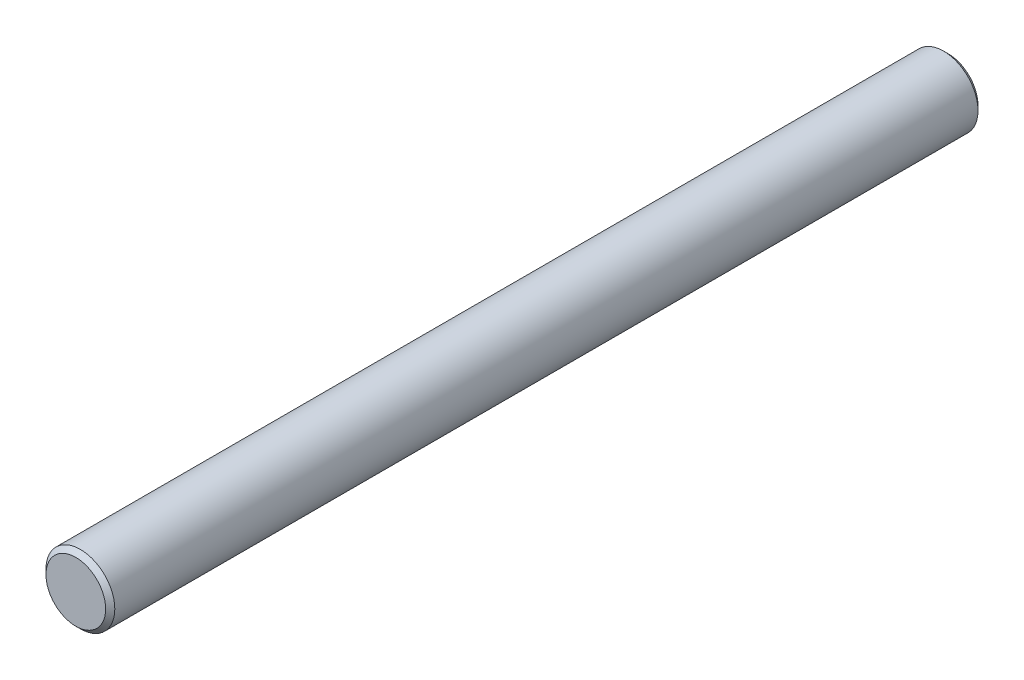
ISO-10303-21;
HEADER;
FILE_DESCRIPTION(('STEP AP214'),'2;1');
FILE_NAME('part.step','',(''),(''),'','','');
FILE_SCHEMA(('AUTOMOTIVE_DESIGN { 1 0 10303 214 1 1 1 1 }'));
ENDSEC;
DATA;
#1=APPLICATION_CONTEXT('core data for automotive mechanical design processes');
#2=APPLICATION_PROTOCOL_DEFINITION('international standard','automotive_design',2000,#1);
#3=PRODUCT_CONTEXT('',#1,'mechanical');
#4=PRODUCT('Part','Part','',(#3));
#5=PRODUCT_RELATED_PRODUCT_CATEGORY('part','',(#4));
#6=PRODUCT_DEFINITION_FORMATION('','',#4);
#7=PRODUCT_DEFINITION_CONTEXT('part definition',#1,'design');
#8=PRODUCT_DEFINITION('design','',#6,#7);
#9=PRODUCT_DEFINITION_SHAPE('','',#8);
#10=(LENGTH_UNIT() NAMED_UNIT(*) SI_UNIT(.MILLI.,.METRE.));
#11=(NAMED_UNIT(*) PLANE_ANGLE_UNIT() SI_UNIT($,.RADIAN.));
#12=(NAMED_UNIT(*) SI_UNIT($,.STERADIAN.) SOLID_ANGLE_UNIT());
#13=UNCERTAINTY_MEASURE_WITH_UNIT(LENGTH_MEASURE(1.E-05),#10,'distance_accuracy_value','');
#14=(GEOMETRIC_REPRESENTATION_CONTEXT(3) GLOBAL_UNCERTAINTY_ASSIGNED_CONTEXT((#13)) GLOBAL_UNIT_ASSIGNED_CONTEXT((#10,
#11,#12)) REPRESENTATION_CONTEXT('',''));
#15=CARTESIAN_POINT('',(0.,0.,0.));
#16=DIRECTION('',(0.,0.,1.));
#17=DIRECTION('',(1.,0.,0.));
#18=AXIS2_PLACEMENT_3D('',#15,#16,#17);
#19=CARTESIAN_POINT('',(0.,0.,19.));
#20=DIRECTION('',(0.,0.,-1.));
#21=DIRECTION('',(-1.,0.,0.));
#22=AXIS2_PLACEMENT_3D('',#19,#20,#21);
#23=CYLINDRICAL_SURFACE('',#22,0.75);
#24=CARTESIAN_POINT('',(0.,0.,0.0999999999999959));
#25=DIRECTION('',(0.,0.,1.));
#26=DIRECTION('',(1.,0.,0.));
#27=AXIS2_PLACEMENT_3D('',#24,#25,#26);
#28=CIRCLE('',#27,0.75);
#29=CARTESIAN_POINT('',(0.75,0.,0.0999999999999959));
#30=VERTEX_POINT('',#29);
#31=EDGE_CURVE('E62',#30,#30,#28,.T.);
#32=ORIENTED_EDGE('',*,*,#31,.T.);
#33=EDGE_LOOP('',(#32));
#34=FACE_BOUND('',#33,.T.);
#35=CARTESIAN_POINT('',(0.,0.,18.9));
#36=DIRECTION('',(0.,0.,1.));
#37=DIRECTION('',(1.,0.,0.));
#38=AXIS2_PLACEMENT_3D('',#35,#36,#37);
#39=CIRCLE('',#38,0.75);
#40=CARTESIAN_POINT('',(0.75,0.,18.9));
#41=VERTEX_POINT('',#40);
#42=EDGE_CURVE('E66',#41,#41,#39,.F.);
#43=ORIENTED_EDGE('',*,*,#42,.T.);
#44=EDGE_LOOP('',(#43));
#45=FACE_BOUND('',#44,.T.);
#46=ADVANCED_FACE('F51',(#34,#45),#23,.T.);
#47=CARTESIAN_POINT('',(0.,0.,19.));
#48=DIRECTION('',(0.,0.,1.));
#49=DIRECTION('',(1.,0.,0.));
#50=AXIS2_PLACEMENT_3D('',#47,#48,#49);
#51=PLANE('',#50);
#52=CARTESIAN_POINT('',(0.,0.,19.));
#53=DIRECTION('',(0.,0.,1.));
#54=DIRECTION('',(1.,0.,0.));
#55=AXIS2_PLACEMENT_3D('',#52,#53,#54);
#56=CIRCLE('',#55,0.649999999999996);
#57=CARTESIAN_POINT('',(0.649999999999996,0.,19.));
#58=VERTEX_POINT('',#57);
#59=EDGE_CURVE('E12',#58,#58,#56,.T.);
#60=ORIENTED_EDGE('',*,*,#59,.T.);
#61=EDGE_LOOP('',(#60));
#62=FACE_BOUND('',#61,.T.);
#63=ADVANCED_FACE('F82',(#62),#51,.T.);
#64=CARTESIAN_POINT('',(0.,0.,0.));
#65=DIRECTION('',(0.,0.,1.));
#66=DIRECTION('',(1.,0.,0.));
#67=AXIS2_PLACEMENT_3D('',#64,#65,#66);
#68=PLANE('',#67);
#69=CARTESIAN_POINT('',(0.,0.,0.));
#70=DIRECTION('',(0.,0.,1.));
#71=DIRECTION('',(1.,0.,0.));
#72=AXIS2_PLACEMENT_3D('',#69,#70,#71);
#73=CIRCLE('',#72,0.650000000000003);
#74=CARTESIAN_POINT('',(0.650000000000003,0.,0.));
#75=VERTEX_POINT('',#74);
#76=EDGE_CURVE('E58',#75,#75,#73,.F.);
#77=ORIENTED_EDGE('',*,*,#76,.T.);
#78=EDGE_LOOP('',(#77));
#79=FACE_BOUND('',#78,.T.);
#80=ADVANCED_FACE('F79',(#79),#68,.F.);
#81=CARTESIAN_POINT('',(0.,0.,0.0999999999999959));
#82=DIRECTION('',(0.,0.,1.));
#83=DIRECTION('',(1.,0.,0.));
#84=AXIS2_PLACEMENT_3D('',#81,#82,#83);
#85=CONICAL_SURFACE('',#84,0.75,0.785398163397454);
#86=ORIENTED_EDGE('',*,*,#76,.F.);
#87=EDGE_LOOP('',(#86));
#88=FACE_BOUND('',#87,.T.);
#89=ORIENTED_EDGE('',*,*,#31,.F.);
#90=EDGE_LOOP('',(#89));
#91=FACE_BOUND('',#90,.T.);
#92=ADVANCED_FACE('F75',(#88,#91),#85,.T.);
#93=CARTESIAN_POINT('',(0.,0.,19.));
#94=DIRECTION('',(0.,0.,-1.));
#95=DIRECTION('',(-1.,0.,0.));
#96=AXIS2_PLACEMENT_3D('',#93,#94,#95);
#97=CONICAL_SURFACE('',#96,0.649999999999996,0.785398163397437);
#98=ORIENTED_EDGE('',*,*,#42,.F.);
#99=EDGE_LOOP('',(#98));
#100=FACE_BOUND('',#99,.T.);
#101=ORIENTED_EDGE('',*,*,#59,.F.);
#102=EDGE_LOOP('',(#101));
#103=FACE_BOUND('',#102,.T.);
#104=ADVANCED_FACE('F53',(#100,#103),#97,.T.);
#105=CLOSED_SHELL('',(#46,#63,#80,#92,#104));
#106=MANIFOLD_SOLID_BREP('B2',#105);
#107=ADVANCED_BREP_SHAPE_REPRESENTATION('',(#18,#106),#14);
#108=SHAPE_DEFINITION_REPRESENTATION(#9,#107);
ENDSEC;
END-ISO-10303-21;
